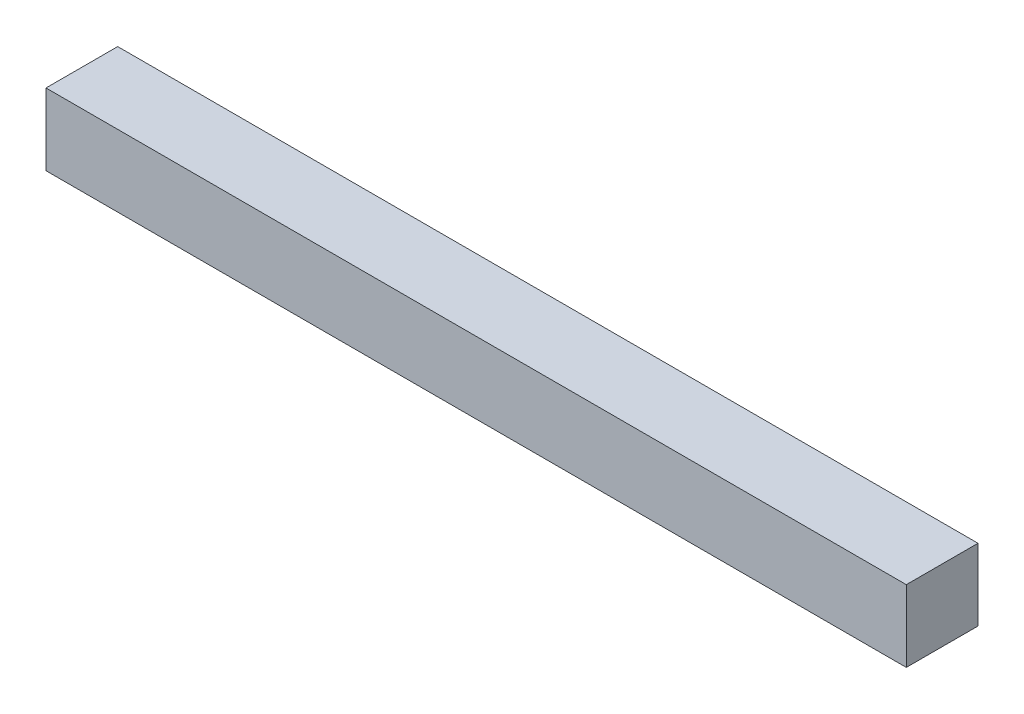
ISO-10303-21;
HEADER;
FILE_DESCRIPTION(('STEP AP214'),'2;1');
FILE_NAME('part.step','',(''),(''),'','','');
FILE_SCHEMA(('AUTOMOTIVE_DESIGN { 1 0 10303 214 1 1 1 1 }'));
ENDSEC;
DATA;
#1=APPLICATION_CONTEXT('core data for automotive mechanical design processes');
#2=APPLICATION_PROTOCOL_DEFINITION('international standard','automotive_design',2000,#1);
#3=PRODUCT_CONTEXT('',#1,'mechanical');
#4=PRODUCT('Part','Part','',(#3));
#5=PRODUCT_RELATED_PRODUCT_CATEGORY('part','',(#4));
#6=PRODUCT_DEFINITION_FORMATION('','',#4);
#7=PRODUCT_DEFINITION_CONTEXT('part definition',#1,'design');
#8=PRODUCT_DEFINITION('design','',#6,#7);
#9=PRODUCT_DEFINITION_SHAPE('','',#8);
#10=(LENGTH_UNIT() NAMED_UNIT(*) SI_UNIT(.MILLI.,.METRE.));
#11=(NAMED_UNIT(*) PLANE_ANGLE_UNIT() SI_UNIT($,.RADIAN.));
#12=(NAMED_UNIT(*) SI_UNIT($,.STERADIAN.) SOLID_ANGLE_UNIT());
#13=UNCERTAINTY_MEASURE_WITH_UNIT(LENGTH_MEASURE(1.E-05),#10,'distance_accuracy_value','');
#14=(GEOMETRIC_REPRESENTATION_CONTEXT(3) GLOBAL_UNCERTAINTY_ASSIGNED_CONTEXT((#13)) GLOBAL_UNIT_ASSIGNED_CONTEXT((#10,
#11,#12)) REPRESENTATION_CONTEXT('',''));
#15=CARTESIAN_POINT('',(0.,0.,0.));
#16=DIRECTION('',(0.,0.,1.));
#17=DIRECTION('',(1.,0.,0.));
#18=AXIS2_PLACEMENT_3D('',#15,#16,#17);
#19=CARTESIAN_POINT('',(304.8,0.,0.));
#20=DIRECTION('',(0.,0.,1.));
#21=DIRECTION('',(1.,0.,0.));
#22=AXIS2_PLACEMENT_3D('',#19,#20,#21);
#23=PLANE('',#22);
#24=DIRECTION('',(0.,1.,0.));
#25=VECTOR('',#24,1.);
#26=CARTESIAN_POINT('',(0.,0.,0.));
#27=LINE('',#26,#25);
#28=CARTESIAN_POINT('',(0.,0.,0.));
#29=VERTEX_POINT('',#28);
#30=CARTESIAN_POINT('',(0.,25.4,0.));
#31=VERTEX_POINT('',#30);
#32=EDGE_CURVE('E115',#29,#31,#27,.T.);
#33=ORIENTED_EDGE('',*,*,#32,.T.);
#34=DIRECTION('',(-1.,0.,0.));
#35=VECTOR('',#34,1.);
#36=CARTESIAN_POINT('',(304.8,25.4,0.));
#37=LINE('',#36,#35);
#38=CARTESIAN_POINT('',(304.8,25.4,0.));
#39=VERTEX_POINT('',#38);
#40=EDGE_CURVE('E11',#39,#31,#37,.T.);
#41=ORIENTED_EDGE('',*,*,#40,.F.);
#42=DIRECTION('',(0.,1.,0.));
#43=VECTOR('',#42,1.);
#44=CARTESIAN_POINT('',(304.8,0.,0.));
#45=LINE('',#44,#43);
#46=CARTESIAN_POINT('',(304.8,0.,0.));
#47=VERTEX_POINT('',#46);
#48=EDGE_CURVE('E98',#47,#39,#45,.T.);
#49=ORIENTED_EDGE('',*,*,#48,.F.);
#50=DIRECTION('',(-1.,0.,0.));
#51=VECTOR('',#50,1.);
#52=CARTESIAN_POINT('',(304.8,0.,0.));
#53=LINE('',#52,#51);
#54=EDGE_CURVE('E111',#47,#29,#53,.T.);
#55=ORIENTED_EDGE('',*,*,#54,.T.);
#56=EDGE_LOOP('',(#33,#41,#49,#55));
#57=FACE_BOUND('',#56,.T.);
#58=ADVANCED_FACE('F38',(#57),#23,.F.);
#59=CARTESIAN_POINT('',(304.8,25.4,0.));
#60=DIRECTION('',(0.,-1.,0.));
#61=DIRECTION('',(0.,0.,-1.));
#62=AXIS2_PLACEMENT_3D('',#59,#60,#61);
#63=PLANE('',#62);
#64=DIRECTION('',(0.,0.,1.));
#65=VECTOR('',#64,1.);
#66=CARTESIAN_POINT('',(0.,25.4,0.));
#67=LINE('',#66,#65);
#68=CARTESIAN_POINT('',(0.,25.4,25.4));
#69=VERTEX_POINT('',#68);
#70=EDGE_CURVE('E103',#31,#69,#67,.T.);
#71=ORIENTED_EDGE('',*,*,#70,.T.);
#72=DIRECTION('',(-1.,0.,0.));
#73=VECTOR('',#72,1.);
#74=CARTESIAN_POINT('',(304.8,25.4,25.4));
#75=LINE('',#74,#73);
#76=CARTESIAN_POINT('',(304.8,25.4,25.4));
#77=VERTEX_POINT('',#76);
#78=EDGE_CURVE('E47',#77,#69,#75,.T.);
#79=ORIENTED_EDGE('',*,*,#78,.F.);
#80=DIRECTION('',(0.,0.,1.));
#81=VECTOR('',#80,1.);
#82=CARTESIAN_POINT('',(304.8,25.4,0.));
#83=LINE('',#82,#81);
#84=EDGE_CURVE('E93',#39,#77,#83,.T.);
#85=ORIENTED_EDGE('',*,*,#84,.F.);
#86=ORIENTED_EDGE('',*,*,#40,.T.);
#87=EDGE_LOOP('',(#71,#79,#85,#86));
#88=FACE_BOUND('',#87,.T.);
#89=ADVANCED_FACE('F102',(#88),#63,.F.);
#90=CARTESIAN_POINT('',(304.8,0.,25.4));
#91=DIRECTION('',(0.,0.,-1.));
#92=DIRECTION('',(-1.,0.,0.));
#93=AXIS2_PLACEMENT_3D('',#90,#91,#92);
#94=PLANE('',#93);
#95=DIRECTION('',(0.,-1.,0.));
#96=VECTOR('',#95,1.);
#97=CARTESIAN_POINT('',(0.,0.,25.4));
#98=LINE('',#97,#96);
#99=CARTESIAN_POINT('',(0.,0.,25.4));
#100=VERTEX_POINT('',#99);
#101=EDGE_CURVE('E78',#69,#100,#98,.T.);
#102=ORIENTED_EDGE('',*,*,#101,.T.);
#103=DIRECTION('',(-1.,0.,0.));
#104=VECTOR('',#103,1.);
#105=CARTESIAN_POINT('',(304.8,0.,25.4));
#106=LINE('',#105,#104);
#107=CARTESIAN_POINT('',(304.8,0.,25.4));
#108=VERTEX_POINT('',#107);
#109=EDGE_CURVE('E105',#108,#100,#106,.T.);
#110=ORIENTED_EDGE('',*,*,#109,.F.);
#111=DIRECTION('',(0.,-1.,0.));
#112=VECTOR('',#111,1.);
#113=CARTESIAN_POINT('',(304.8,0.,25.4));
#114=LINE('',#113,#112);
#115=EDGE_CURVE('E96',#77,#108,#114,.T.);
#116=ORIENTED_EDGE('',*,*,#115,.F.);
#117=ORIENTED_EDGE('',*,*,#78,.T.);
#118=EDGE_LOOP('',(#102,#110,#116,#117));
#119=FACE_BOUND('',#118,.T.);
#120=ADVANCED_FACE('F106',(#119),#94,.F.);
#121=CARTESIAN_POINT('',(304.8,0.,0.));
#122=DIRECTION('',(0.,1.,0.));
#123=DIRECTION('',(0.,0.,1.));
#124=AXIS2_PLACEMENT_3D('',#121,#122,#123);
#125=PLANE('',#124);
#126=DIRECTION('',(0.,0.,-1.));
#127=VECTOR('',#126,1.);
#128=CARTESIAN_POINT('',(0.,0.,0.));
#129=LINE('',#128,#127);
#130=EDGE_CURVE('E86',#100,#29,#129,.T.);
#131=ORIENTED_EDGE('',*,*,#130,.T.);
#132=ORIENTED_EDGE('',*,*,#54,.F.);
#133=DIRECTION('',(0.,0.,-1.));
#134=VECTOR('',#133,1.);
#135=CARTESIAN_POINT('',(304.8,0.,0.));
#136=LINE('',#135,#134);
#137=EDGE_CURVE('E58',#108,#47,#136,.T.);
#138=ORIENTED_EDGE('',*,*,#137,.F.);
#139=ORIENTED_EDGE('',*,*,#109,.T.);
#140=EDGE_LOOP('',(#131,#132,#138,#139));
#141=FACE_BOUND('',#140,.T.);
#142=ADVANCED_FACE('F127',(#141),#125,.F.);
#143=CARTESIAN_POINT('',(304.8,0.,0.));
#144=DIRECTION('',(1.,0.,0.));
#145=DIRECTION('',(0.,0.,-1.));
#146=AXIS2_PLACEMENT_3D('',#143,#144,#145);
#147=PLANE('',#146);
#148=ORIENTED_EDGE('',*,*,#48,.T.);
#149=ORIENTED_EDGE('',*,*,#84,.T.);
#150=ORIENTED_EDGE('',*,*,#115,.T.);
#151=ORIENTED_EDGE('',*,*,#137,.T.);
#152=EDGE_LOOP('',(#148,#149,#150,#151));
#153=FACE_BOUND('',#152,.T.);
#154=ADVANCED_FACE('F94',(#153),#147,.T.);
#155=CARTESIAN_POINT('',(0.,0.,0.));
#156=DIRECTION('',(1.,0.,0.));
#157=DIRECTION('',(0.,0.,-1.));
#158=AXIS2_PLACEMENT_3D('',#155,#156,#157);
#159=PLANE('',#158);
#160=ORIENTED_EDGE('',*,*,#32,.F.);
#161=ORIENTED_EDGE('',*,*,#130,.F.);
#162=ORIENTED_EDGE('',*,*,#101,.F.);
#163=ORIENTED_EDGE('',*,*,#70,.F.);
#164=EDGE_LOOP('',(#160,#161,#162,#163));
#165=FACE_BOUND('',#164,.T.);
#166=ADVANCED_FACE('F130',(#165),#159,.F.);
#167=CLOSED_SHELL('',(#58,#89,#120,#142,#154,#166));
#168=MANIFOLD_SOLID_BREP('B2',#167);
#169=ADVANCED_BREP_SHAPE_REPRESENTATION('',(#18,#168),#14);
#170=SHAPE_DEFINITION_REPRESENTATION(#9,#169);
ENDSEC;
END-ISO-10303-21;
